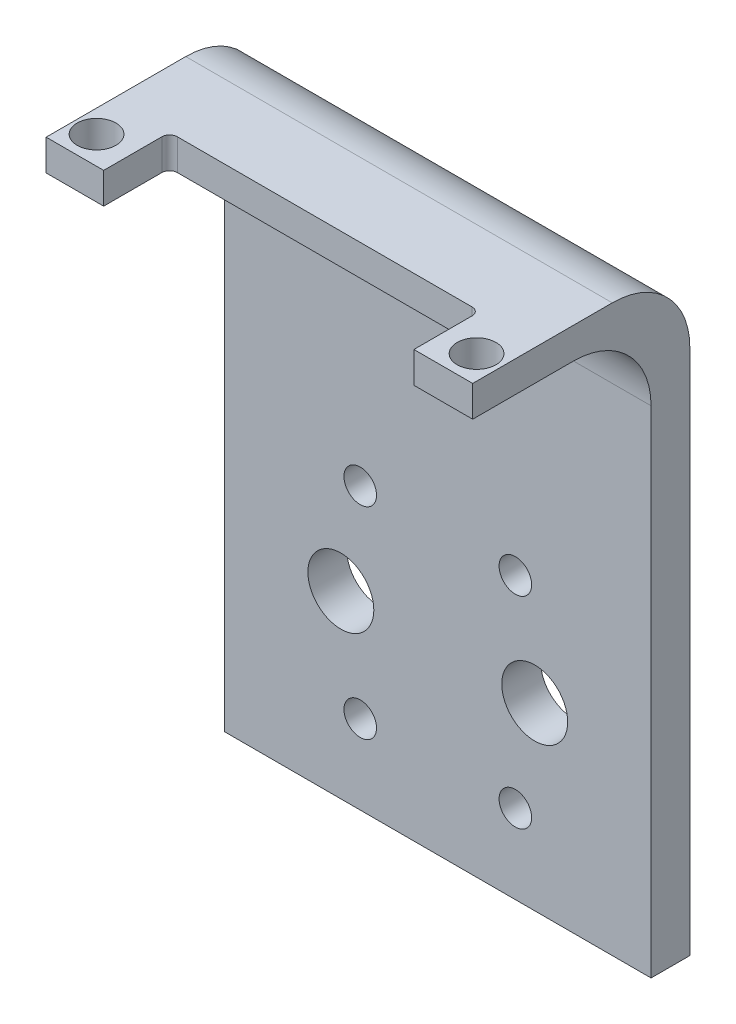
ISO-10303-21;
HEADER;
FILE_DESCRIPTION(('STEP AP214'),'2;1');
FILE_NAME('part.step','',(''),(''),'','','');
FILE_SCHEMA(('AUTOMOTIVE_DESIGN { 1 0 10303 214 1 1 1 1 }'));
ENDSEC;
DATA;
#1=APPLICATION_CONTEXT('core data for automotive mechanical design processes');
#2=APPLICATION_PROTOCOL_DEFINITION('international standard','automotive_design',2000,#1);
#3=PRODUCT_CONTEXT('',#1,'mechanical');
#4=PRODUCT('Part','Part','',(#3));
#5=PRODUCT_RELATED_PRODUCT_CATEGORY('part','',(#4));
#6=PRODUCT_DEFINITION_FORMATION('','',#4);
#7=PRODUCT_DEFINITION_CONTEXT('part definition',#1,'design');
#8=PRODUCT_DEFINITION('design','',#6,#7);
#9=PRODUCT_DEFINITION_SHAPE('','',#8);
#10=(LENGTH_UNIT() NAMED_UNIT(*) SI_UNIT(.MILLI.,.METRE.));
#11=(NAMED_UNIT(*) PLANE_ANGLE_UNIT() SI_UNIT($,.RADIAN.));
#12=(NAMED_UNIT(*) SI_UNIT($,.STERADIAN.) SOLID_ANGLE_UNIT());
#13=UNCERTAINTY_MEASURE_WITH_UNIT(LENGTH_MEASURE(1.E-05),#10,'distance_accuracy_value','');
#14=(GEOMETRIC_REPRESENTATION_CONTEXT(3) GLOBAL_UNCERTAINTY_ASSIGNED_CONTEXT((#13)) GLOBAL_UNIT_ASSIGNED_CONTEXT((#10,
#11,#12)) REPRESENTATION_CONTEXT('',''));
#15=CARTESIAN_POINT('',(0.,0.,0.));
#16=DIRECTION('',(0.,0.,1.));
#17=DIRECTION('',(1.,0.,0.));
#18=AXIS2_PLACEMENT_3D('',#15,#16,#17);
#19=CARTESIAN_POINT('',(-27.4176015384619,54.1685848951049,28.));
#20=DIRECTION('',(0.,0.,-1.));
#21=DIRECTION('',(-1.,0.,0.));
#22=AXIS2_PLACEMENT_3D('',#19,#20,#21);
#23=PLANE('',#22);
#24=DIRECTION('',(1.,0.,0.));
#25=VECTOR('',#24,1.);
#26=CARTESIAN_POINT('',(-27.4176015384619,54.1685848951049,28.));
#27=LINE('',#26,#25);
#28=CARTESIAN_POINT('',(20.,54.1685848951049,28.));
#29=VERTEX_POINT('',#28);
#30=CARTESIAN_POINT('',(27.5823984615396,54.1685848951049,28.));
#31=VERTEX_POINT('',#30);
#32=EDGE_CURVE('E211',#29,#31,#27,.T.);
#33=ORIENTED_EDGE('',*,*,#32,.F.);
#34=DIRECTION('',(0.,-1.,0.));
#35=VECTOR('',#34,1.);
#36=CARTESIAN_POINT('',(20.,54.1685848951049,28.));
#37=LINE('',#36,#35);
#38=CARTESIAN_POINT('',(20.,50.1685848951049,28.));
#39=VERTEX_POINT('',#38);
#40=EDGE_CURVE('E203',#29,#39,#37,.T.);
#41=ORIENTED_EDGE('',*,*,#40,.T.);
#42=DIRECTION('',(1.,0.,0.));
#43=VECTOR('',#42,1.);
#44=CARTESIAN_POINT('',(-27.4176015384619,50.1685848951049,28.));
#45=LINE('',#44,#43);
#46=CARTESIAN_POINT('',(27.5823984615396,50.1685848951049,28.));
#47=VERTEX_POINT('',#46);
#48=EDGE_CURVE('E224',#39,#47,#45,.T.);
#49=ORIENTED_EDGE('',*,*,#48,.T.);
#50=DIRECTION('',(0.,-1.,0.));
#51=VECTOR('',#50,1.);
#52=CARTESIAN_POINT('',(27.5823984615396,54.1685848951049,28.));
#53=LINE('',#52,#51);
#54=EDGE_CURVE('E221',#31,#47,#53,.T.);
#55=ORIENTED_EDGE('',*,*,#54,.F.);
#56=EDGE_LOOP('',(#33,#41,#49,#55));
#57=FACE_BOUND('',#56,.T.);
#58=ADVANCED_FACE('F39',(#57),#23,.F.);
#59=CARTESIAN_POINT('',(0.0823984615384559,-88.7275100518437,5.));
#60=DIRECTION('',(0.,0.,1.));
#61=DIRECTION('',(1.,0.,0.));
#62=AXIS2_PLACEMENT_3D('',#59,#60,#61);
#63=PLANE('',#62);
#64=DIRECTION('',(0.,-1.,0.));
#65=VECTOR('',#64,1.);
#66=CARTESIAN_POINT('',(27.5823984615396,30.1685848951049,5.));
#67=LINE('',#66,#65);
#68=CARTESIAN_POINT('',(27.5823984615396,40.1685848951049,5.));
#69=VERTEX_POINT('',#68);
#70=CARTESIAN_POINT('',(27.5823984615396,-23.7275100518435,5.));
#71=VERTEX_POINT('',#70);
#72=EDGE_CURVE('E249',#69,#71,#67,.T.);
#73=ORIENTED_EDGE('',*,*,#72,.F.);
#74=DIRECTION('',(1.,0.,0.));
#75=VECTOR('',#74,1.);
#76=CARTESIAN_POINT('',(0.0823984615384884,40.1685848951049,5.));
#77=LINE('',#76,#75);
#78=CARTESIAN_POINT('',(-27.4176015384619,40.1685848951049,5.));
#79=VERTEX_POINT('',#78);
#80=EDGE_CURVE('E318',#69,#79,#77,.F.);
#81=ORIENTED_EDGE('',*,*,#80,.T.);
#82=DIRECTION('',(0.,1.,0.));
#83=VECTOR('',#82,1.);
#84=CARTESIAN_POINT('',(-27.4176015384619,30.1685848951049,5.));
#85=LINE('',#84,#83);
#86=CARTESIAN_POINT('',(-27.4176015384619,-23.7275100518435,5.));
#87=VERTEX_POINT('',#86);
#88=EDGE_CURVE('E250',#87,#79,#85,.T.);
#89=ORIENTED_EDGE('',*,*,#88,.F.);
#90=DIRECTION('',(-1.,0.,0.));
#91=VECTOR('',#90,1.);
#92=CARTESIAN_POINT('',(-30.472919294877,-23.7275100518435,5.));
#93=LINE('',#92,#91);
#94=EDGE_CURVE('E239',#71,#87,#93,.T.);
#95=ORIENTED_EDGE('',*,*,#94,.F.);
#96=EDGE_LOOP('',(#73,#81,#89,#95));
#97=FACE_BOUND('',#96,.T.);
#98=CARTESIAN_POINT('',(-9.91760153846116,12.4801480931158,5.));
#99=DIRECTION('',(0.,0.,1.));
#100=DIRECTION('',(1.,0.,0.));
#101=AXIS2_PLACEMENT_3D('',#98,#99,#100);
#102=CIRCLE('',#101,2.1);
#103=CARTESIAN_POINT('',(-7.81760153846116,12.4801480931158,5.));
#104=VERTEX_POINT('',#103);
#105=EDGE_CURVE('E271',#104,#104,#102,.T.);
#106=ORIENTED_EDGE('',*,*,#105,.F.);
#107=EDGE_LOOP('',(#106));
#108=FACE_BOUND('',#107,.T.);
#109=CARTESIAN_POINT('',(-9.91760153846117,-13.5198519068842,5.));
#110=DIRECTION('',(0.,0.,1.));
#111=DIRECTION('',(1.,0.,0.));
#112=AXIS2_PLACEMENT_3D('',#109,#110,#111);
#113=CIRCLE('',#112,2.09999999999999);
#114=CARTESIAN_POINT('',(-7.81760153846118,-13.5198519068842,5.));
#115=VERTEX_POINT('',#114);
#116=EDGE_CURVE('E287',#115,#115,#113,.T.);
#117=ORIENTED_EDGE('',*,*,#116,.F.);
#118=EDGE_LOOP('',(#117));
#119=FACE_BOUND('',#118,.T.);
#120=CARTESIAN_POINT('',(12.5823984615388,-0.519851906884222,5.));
#121=DIRECTION('',(0.,0.,1.));
#122=DIRECTION('',(1.,0.,0.));
#123=AXIS2_PLACEMENT_3D('',#120,#121,#122);
#124=CIRCLE('',#123,4.25);
#125=CARTESIAN_POINT('',(16.8323984615388,-0.519851906884222,5.));
#126=VERTEX_POINT('',#125);
#127=EDGE_CURVE('E303',#126,#126,#124,.T.);
#128=ORIENTED_EDGE('',*,*,#127,.F.);
#129=EDGE_LOOP('',(#128));
#130=FACE_BOUND('',#129,.T.);
#131=CARTESIAN_POINT('',(10.0823984615388,-13.5198519068842,5.));
#132=DIRECTION('',(0.,0.,1.));
#133=DIRECTION('',(1.,0.,0.));
#134=AXIS2_PLACEMENT_3D('',#131,#132,#133);
#135=CIRCLE('',#134,2.1);
#136=CARTESIAN_POINT('',(12.1823984615388,-13.5198519068842,5.));
#137=VERTEX_POINT('',#136);
#138=EDGE_CURVE('E295',#137,#137,#135,.T.);
#139=ORIENTED_EDGE('',*,*,#138,.F.);
#140=EDGE_LOOP('',(#139));
#141=FACE_BOUND('',#140,.T.);
#142=CARTESIAN_POINT('',(-12.4176015384612,-0.519851906884215,5.));
#143=DIRECTION('',(0.,0.,1.));
#144=DIRECTION('',(1.,0.,0.));
#145=AXIS2_PLACEMENT_3D('',#142,#143,#144);
#146=CIRCLE('',#145,4.25);
#147=CARTESIAN_POINT('',(-8.16760153846116,-0.519851906884215,5.));
#148=VERTEX_POINT('',#147);
#149=EDGE_CURVE('E279',#148,#148,#146,.T.);
#150=ORIENTED_EDGE('',*,*,#149,.F.);
#151=EDGE_LOOP('',(#150));
#152=FACE_BOUND('',#151,.T.);
#153=CARTESIAN_POINT('',(10.0823984615388,12.4801480931158,5.));
#154=DIRECTION('',(0.,0.,1.));
#155=DIRECTION('',(1.,0.,0.));
#156=AXIS2_PLACEMENT_3D('',#153,#154,#155);
#157=CIRCLE('',#156,2.09999999999999);
#158=CARTESIAN_POINT('',(12.1823984615388,12.4801480931158,5.));
#159=VERTEX_POINT('',#158);
#160=EDGE_CURVE('E263',#159,#159,#157,.T.);
#161=ORIENTED_EDGE('',*,*,#160,.F.);
#162=EDGE_LOOP('',(#161));
#163=FACE_BOUND('',#162,.T.);
#164=ADVANCED_FACE('F355',(#97,#108,#119,#130,#141,#152,#163),#63,.T.);
#165=CARTESIAN_POINT('',(0.0823984615384559,-88.7275100518437,0.));
#166=DIRECTION('',(0.,0.,1.));
#167=DIRECTION('',(1.,0.,0.));
#168=AXIS2_PLACEMENT_3D('',#165,#166,#167);
#169=PLANE('',#168);
#170=DIRECTION('',(0.,1.,0.));
#171=VECTOR('',#170,1.);
#172=CARTESIAN_POINT('',(-27.4176015384619,-88.7275100518437,0.));
#173=LINE('',#172,#171);
#174=CARTESIAN_POINT('',(-27.4176015384619,-23.7275100518435,0.));
#175=VERTEX_POINT('',#174);
#176=CARTESIAN_POINT('',(-27.4176015384619,44.1685848951049,0.));
#177=VERTEX_POINT('',#176);
#178=EDGE_CURVE('E259',#175,#177,#173,.T.);
#179=ORIENTED_EDGE('',*,*,#178,.T.);
#180=DIRECTION('',(-1.,0.,0.));
#181=VECTOR('',#180,1.);
#182=CARTESIAN_POINT('',(27.5823984615396,44.1685848951049,0.));
#183=LINE('',#182,#181);
#184=CARTESIAN_POINT('',(27.5823984615396,44.1685848951049,0.));
#185=VERTEX_POINT('',#184);
#186=EDGE_CURVE('E63',#177,#185,#183,.F.);
#187=ORIENTED_EDGE('',*,*,#186,.T.);
#188=DIRECTION('',(0.,-1.,0.));
#189=VECTOR('',#188,1.);
#190=CARTESIAN_POINT('',(27.5823984615396,-88.7275100518437,0.));
#191=LINE('',#190,#189);
#192=CARTESIAN_POINT('',(27.5823984615396,-23.7275100518435,0.));
#193=VERTEX_POINT('',#192);
#194=EDGE_CURVE('E254',#185,#193,#191,.T.);
#195=ORIENTED_EDGE('',*,*,#194,.T.);
#196=DIRECTION('',(-1.,0.,0.));
#197=VECTOR('',#196,1.);
#198=CARTESIAN_POINT('',(0.0823984615384559,-23.7275100518435,0.));
#199=LINE('',#198,#197);
#200=EDGE_CURVE('E242',#193,#175,#199,.T.);
#201=ORIENTED_EDGE('',*,*,#200,.T.);
#202=EDGE_LOOP('',(#179,#187,#195,#201));
#203=FACE_BOUND('',#202,.T.);
#204=CARTESIAN_POINT('',(10.0823984615388,12.4801480931158,0.));
#205=DIRECTION('',(0.,0.,1.));
#206=DIRECTION('',(1.,0.,0.));
#207=AXIS2_PLACEMENT_3D('',#204,#205,#206);
#208=CIRCLE('',#207,2.09999999999999);
#209=CARTESIAN_POINT('',(12.1823984615388,12.4801480931158,0.));
#210=VERTEX_POINT('',#209);
#211=EDGE_CURVE('E262',#210,#210,#208,.T.);
#212=ORIENTED_EDGE('',*,*,#211,.T.);
#213=EDGE_LOOP('',(#212));
#214=FACE_BOUND('',#213,.T.);
#215=CARTESIAN_POINT('',(-9.91760153846116,12.4801480931158,0.));
#216=DIRECTION('',(0.,0.,1.));
#217=DIRECTION('',(1.,0.,0.));
#218=AXIS2_PLACEMENT_3D('',#215,#216,#217);
#219=CIRCLE('',#218,2.1);
#220=CARTESIAN_POINT('',(-7.81760153846116,12.4801480931158,0.));
#221=VERTEX_POINT('',#220);
#222=EDGE_CURVE('E267',#221,#221,#219,.T.);
#223=ORIENTED_EDGE('',*,*,#222,.T.);
#224=EDGE_LOOP('',(#223));
#225=FACE_BOUND('',#224,.T.);
#226=CARTESIAN_POINT('',(-12.4176015384612,-0.519851906884215,0.));
#227=DIRECTION('',(0.,0.,1.));
#228=DIRECTION('',(1.,0.,0.));
#229=AXIS2_PLACEMENT_3D('',#226,#227,#228);
#230=CIRCLE('',#229,4.25);
#231=CARTESIAN_POINT('',(-8.16760153846116,-0.519851906884215,0.));
#232=VERTEX_POINT('',#231);
#233=EDGE_CURVE('E275',#232,#232,#230,.T.);
#234=ORIENTED_EDGE('',*,*,#233,.T.);
#235=EDGE_LOOP('',(#234));
#236=FACE_BOUND('',#235,.T.);
#237=CARTESIAN_POINT('',(-9.91760153846117,-13.5198519068842,0.));
#238=DIRECTION('',(0.,0.,1.));
#239=DIRECTION('',(1.,0.,0.));
#240=AXIS2_PLACEMENT_3D('',#237,#238,#239);
#241=CIRCLE('',#240,2.09999999999999);
#242=CARTESIAN_POINT('',(-7.81760153846118,-13.5198519068842,0.));
#243=VERTEX_POINT('',#242);
#244=EDGE_CURVE('E283',#243,#243,#241,.T.);
#245=ORIENTED_EDGE('',*,*,#244,.T.);
#246=EDGE_LOOP('',(#245));
#247=FACE_BOUND('',#246,.T.);
#248=CARTESIAN_POINT('',(10.0823984615388,-13.5198519068842,0.));
#249=DIRECTION('',(0.,0.,1.));
#250=DIRECTION('',(1.,0.,0.));
#251=AXIS2_PLACEMENT_3D('',#248,#249,#250);
#252=CIRCLE('',#251,2.1);
#253=CARTESIAN_POINT('',(12.1823984615388,-13.5198519068842,0.));
#254=VERTEX_POINT('',#253);
#255=EDGE_CURVE('E291',#254,#254,#252,.T.);
#256=ORIENTED_EDGE('',*,*,#255,.T.);
#257=EDGE_LOOP('',(#256));
#258=FACE_BOUND('',#257,.T.);
#259=CARTESIAN_POINT('',(12.5823984615388,-0.519851906884222,0.));
#260=DIRECTION('',(0.,0.,1.));
#261=DIRECTION('',(1.,0.,0.));
#262=AXIS2_PLACEMENT_3D('',#259,#260,#261);
#263=CIRCLE('',#262,4.25);
#264=CARTESIAN_POINT('',(16.8323984615388,-0.519851906884222,0.));
#265=VERTEX_POINT('',#264);
#266=EDGE_CURVE('E299',#265,#265,#263,.T.);
#267=ORIENTED_EDGE('',*,*,#266,.T.);
#268=EDGE_LOOP('',(#267));
#269=FACE_BOUND('',#268,.T.);
#270=ADVANCED_FACE('F362',(#203,#214,#225,#236,#247,#258,#269),#169,.F.);
#271=CARTESIAN_POINT('',(12.5823984615388,-0.519851906884222,5.));
#272=DIRECTION('',(0.,0.,-1.));
#273=DIRECTION('',(-1.,0.,0.));
#274=AXIS2_PLACEMENT_3D('',#271,#272,#273);
#275=CYLINDRICAL_SURFACE('',#274,4.25);
#276=ORIENTED_EDGE('',*,*,#127,.T.);
#277=EDGE_LOOP('',(#276));
#278=FACE_BOUND('',#277,.T.);
#279=ORIENTED_EDGE('',*,*,#266,.F.);
#280=EDGE_LOOP('',(#279));
#281=FACE_BOUND('',#280,.T.);
#282=ADVANCED_FACE('F527',(#278,#281),#275,.F.);
#283=CARTESIAN_POINT('',(10.0823984615388,-13.5198519068842,5.));
#284=DIRECTION('',(0.,0.,-1.));
#285=DIRECTION('',(-1.,0.,0.));
#286=AXIS2_PLACEMENT_3D('',#283,#284,#285);
#287=CYLINDRICAL_SURFACE('',#286,2.1);
#288=ORIENTED_EDGE('',*,*,#138,.T.);
#289=EDGE_LOOP('',(#288));
#290=FACE_BOUND('',#289,.T.);
#291=ORIENTED_EDGE('',*,*,#255,.F.);
#292=EDGE_LOOP('',(#291));
#293=FACE_BOUND('',#292,.T.);
#294=ADVANCED_FACE('F581',(#290,#293),#287,.F.);
#295=CARTESIAN_POINT('',(-9.91760153846117,-13.5198519068842,5.));
#296=DIRECTION('',(0.,0.,-1.));
#297=DIRECTION('',(-1.,0.,0.));
#298=AXIS2_PLACEMENT_3D('',#295,#296,#297);
#299=CYLINDRICAL_SURFACE('',#298,2.09999999999999);
#300=ORIENTED_EDGE('',*,*,#116,.T.);
#301=EDGE_LOOP('',(#300));
#302=FACE_BOUND('',#301,.T.);
#303=ORIENTED_EDGE('',*,*,#244,.F.);
#304=EDGE_LOOP('',(#303));
#305=FACE_BOUND('',#304,.T.);
#306=ADVANCED_FACE('F571',(#302,#305),#299,.F.);
#307=CARTESIAN_POINT('',(-12.4176015384612,-0.519851906884215,5.));
#308=DIRECTION('',(0.,0.,-1.));
#309=DIRECTION('',(-1.,0.,0.));
#310=AXIS2_PLACEMENT_3D('',#307,#308,#309);
#311=CYLINDRICAL_SURFACE('',#310,4.25);
#312=ORIENTED_EDGE('',*,*,#149,.T.);
#313=EDGE_LOOP('',(#312));
#314=FACE_BOUND('',#313,.T.);
#315=ORIENTED_EDGE('',*,*,#233,.F.);
#316=EDGE_LOOP('',(#315));
#317=FACE_BOUND('',#316,.T.);
#318=ADVANCED_FACE('F561',(#314,#317),#311,.F.);
#319=CARTESIAN_POINT('',(-9.91760153846116,12.4801480931158,5.));
#320=DIRECTION('',(0.,0.,-1.));
#321=DIRECTION('',(-1.,0.,0.));
#322=AXIS2_PLACEMENT_3D('',#319,#320,#321);
#323=CYLINDRICAL_SURFACE('',#322,2.1);
#324=ORIENTED_EDGE('',*,*,#105,.T.);
#325=EDGE_LOOP('',(#324));
#326=FACE_BOUND('',#325,.T.);
#327=ORIENTED_EDGE('',*,*,#222,.F.);
#328=EDGE_LOOP('',(#327));
#329=FACE_BOUND('',#328,.T.);
#330=ADVANCED_FACE('F551',(#326,#329),#323,.F.);
#331=CARTESIAN_POINT('',(10.0823984615388,12.4801480931158,5.));
#332=DIRECTION('',(0.,0.,-1.));
#333=DIRECTION('',(-1.,0.,0.));
#334=AXIS2_PLACEMENT_3D('',#331,#332,#333);
#335=CYLINDRICAL_SURFACE('',#334,2.09999999999999);
#336=ORIENTED_EDGE('',*,*,#160,.T.);
#337=EDGE_LOOP('',(#336));
#338=FACE_BOUND('',#337,.T.);
#339=ORIENTED_EDGE('',*,*,#211,.F.);
#340=EDGE_LOOP('',(#339));
#341=FACE_BOUND('',#340,.T.);
#342=ADVANCED_FACE('F516',(#338,#341),#335,.F.);
#343=CARTESIAN_POINT('',(27.5823984615396,30.1685848951049,-5.));
#344=DIRECTION('',(-1.,0.,0.));
#345=DIRECTION('',(0.,0.,1.));
#346=AXIS2_PLACEMENT_3D('',#343,#344,#345);
#347=PLANE('',#346);
#348=ORIENTED_EDGE('',*,*,#194,.F.);
#349=CARTESIAN_POINT('',(27.5823984615396,44.1685848951049,10.));
#350=DIRECTION('',(-1.,0.,0.));
#351=DIRECTION('',(0.,0.,1.));
#352=AXIS2_PLACEMENT_3D('',#349,#350,#351);
#353=CIRCLE('',#352,10.);
#354=CARTESIAN_POINT('',(27.5823984615396,54.1685848951049,10.));
#355=VERTEX_POINT('',#354);
#356=EDGE_CURVE('E330',#185,#355,#353,.F.);
#357=ORIENTED_EDGE('',*,*,#356,.T.);
#358=DIRECTION('',(0.,0.,-1.));
#359=VECTOR('',#358,1.);
#360=CARTESIAN_POINT('',(27.5823984615396,54.1685848951049,0.));
#361=LINE('',#360,#359);
#362=EDGE_CURVE('E217',#31,#355,#361,.T.);
#363=ORIENTED_EDGE('',*,*,#362,.F.);
#364=ORIENTED_EDGE('',*,*,#54,.T.);
#365=DIRECTION('',(0.,0.,-1.));
#366=VECTOR('',#365,1.);
#367=CARTESIAN_POINT('',(27.5823984615396,50.1685848951049,0.));
#368=LINE('',#367,#366);
#369=CARTESIAN_POINT('',(27.5823984615396,50.1685848951049,15.));
#370=VERTEX_POINT('',#369);
#371=EDGE_CURVE('E212',#47,#370,#368,.T.);
#372=ORIENTED_EDGE('',*,*,#371,.T.);
#373=CARTESIAN_POINT('',(27.5823984615396,40.1685848951049,15.));
#374=DIRECTION('',(-1.,0.,0.));
#375=DIRECTION('',(0.,0.,1.));
#376=AXIS2_PLACEMENT_3D('',#373,#374,#375);
#377=CIRCLE('',#376,10.);
#378=EDGE_CURVE('E333',#370,#69,#377,.T.);
#379=ORIENTED_EDGE('',*,*,#378,.T.);
#380=ORIENTED_EDGE('',*,*,#72,.T.);
#381=DIRECTION('',(0.,0.,-1.));
#382=VECTOR('',#381,1.);
#383=CARTESIAN_POINT('',(27.5823984615396,-23.7275100518435,-5.));
#384=LINE('',#383,#382);
#385=EDGE_CURVE('E245',#71,#193,#384,.T.);
#386=ORIENTED_EDGE('',*,*,#385,.T.);
#387=EDGE_LOOP('',(#348,#357,#363,#364,#372,#379,#380,#386));
#388=FACE_BOUND('',#387,.T.);
#389=ADVANCED_FACE('F351',(#388),#347,.F.);
#390=CARTESIAN_POINT('',(-27.4176015384619,30.1685848951049,-5.));
#391=DIRECTION('',(1.,0.,0.));
#392=DIRECTION('',(0.,0.,-1.));
#393=AXIS2_PLACEMENT_3D('',#390,#391,#392);
#394=PLANE('',#393);
#395=DIRECTION('',(0.,0.,1.));
#396=VECTOR('',#395,1.);
#397=CARTESIAN_POINT('',(-27.4176015384619,54.1685848951049,0.));
#398=LINE('',#397,#396);
#399=CARTESIAN_POINT('',(-27.4176015384619,54.1685848951049,10.));
#400=VERTEX_POINT('',#399);
#401=CARTESIAN_POINT('',(-27.4176015384619,54.1685848951049,28.));
#402=VERTEX_POINT('',#401);
#403=EDGE_CURVE('E208',#400,#402,#398,.T.);
#404=ORIENTED_EDGE('',*,*,#403,.F.);
#405=CARTESIAN_POINT('',(-27.4176015384619,44.1685848951049,10.));
#406=DIRECTION('',(1.,0.,0.));
#407=DIRECTION('',(0.,0.,-1.));
#408=AXIS2_PLACEMENT_3D('',#405,#406,#407);
#409=CIRCLE('',#408,10.);
#410=EDGE_CURVE('E325',#400,#177,#409,.F.);
#411=ORIENTED_EDGE('',*,*,#410,.T.);
#412=ORIENTED_EDGE('',*,*,#178,.F.);
#413=DIRECTION('',(0.,0.,1.));
#414=VECTOR('',#413,1.);
#415=CARTESIAN_POINT('',(-27.4176015384619,-23.7275100518435,-5.));
#416=LINE('',#415,#414);
#417=EDGE_CURVE('E307',#175,#87,#416,.T.);
#418=ORIENTED_EDGE('',*,*,#417,.T.);
#419=ORIENTED_EDGE('',*,*,#88,.T.);
#420=CARTESIAN_POINT('',(-27.4176015384619,40.1685848951049,15.));
#421=DIRECTION('',(1.,0.,0.));
#422=DIRECTION('',(0.,0.,-1.));
#423=AXIS2_PLACEMENT_3D('',#420,#421,#422);
#424=CIRCLE('',#423,10.);
#425=CARTESIAN_POINT('',(-27.4176015384619,50.1685848951049,15.));
#426=VERTEX_POINT('',#425);
#427=EDGE_CURVE('E48',#79,#426,#424,.T.);
#428=ORIENTED_EDGE('',*,*,#427,.T.);
#429=DIRECTION('',(0.,0.,1.));
#430=VECTOR('',#429,1.);
#431=CARTESIAN_POINT('',(-27.4176015384619,50.1685848951049,0.));
#432=LINE('',#431,#430);
#433=CARTESIAN_POINT('',(-27.4176015384619,50.1685848951049,28.));
#434=VERTEX_POINT('',#433);
#435=EDGE_CURVE('E207',#426,#434,#432,.T.);
#436=ORIENTED_EDGE('',*,*,#435,.T.);
#437=DIRECTION('',(0.,-1.,0.));
#438=VECTOR('',#437,1.);
#439=CARTESIAN_POINT('',(-27.4176015384619,54.1685848951049,28.));
#440=LINE('',#439,#438);
#441=EDGE_CURVE('E235',#402,#434,#440,.T.);
#442=ORIENTED_EDGE('',*,*,#441,.F.);
#443=EDGE_LOOP('',(#404,#411,#412,#418,#419,#428,#436,#442));
#444=FACE_BOUND('',#443,.T.);
#445=ADVANCED_FACE('F340',(#444),#394,.F.);
#446=CARTESIAN_POINT('',(-30.472919294877,-23.7275100518435,-5.));
#447=DIRECTION('',(0.,1.,0.));
#448=DIRECTION('',(0.,0.,1.));
#449=AXIS2_PLACEMENT_3D('',#446,#447,#448);
#450=PLANE('',#449);
#451=ORIENTED_EDGE('',*,*,#200,.F.);
#452=ORIENTED_EDGE('',*,*,#385,.F.);
#453=ORIENTED_EDGE('',*,*,#94,.T.);
#454=ORIENTED_EDGE('',*,*,#417,.F.);
#455=EDGE_LOOP('',(#451,#452,#453,#454));
#456=FACE_BOUND('',#455,.T.);
#457=ADVANCED_FACE('F360',(#456),#450,.F.);
#458=CARTESIAN_POINT('',(0.,50.1685848951049,0.));
#459=DIRECTION('',(0.,1.,0.));
#460=DIRECTION('',(-1.,0.,0.));
#461=AXIS2_PLACEMENT_3D('',#458,#459,#460);
#462=PLANE('',#461);
#463=CARTESIAN_POINT('',(24.5,50.1685848951049,24.42));
#464=DIRECTION('',(0.,1.,0.));
#465=DIRECTION('',(1.,0.,0.));
#466=AXIS2_PLACEMENT_3D('',#463,#464,#465);
#467=CIRCLE('',#466,2.49999999999999);
#468=CARTESIAN_POINT('',(27.,50.1685848951049,24.42));
#469=VERTEX_POINT('',#468);
#470=EDGE_CURVE('E648',#469,#469,#467,.T.);
#471=ORIENTED_EDGE('',*,*,#470,.T.);
#472=EDGE_LOOP('',(#471));
#473=FACE_BOUND('',#472,.T.);
#474=CARTESIAN_POINT('',(-24.5,50.1685848951049,24.42));
#475=DIRECTION('',(0.,1.,0.));
#476=DIRECTION('',(-1.,0.,0.));
#477=AXIS2_PLACEMENT_3D('',#474,#475,#476);
#478=CIRCLE('',#477,2.5);
#479=CARTESIAN_POINT('',(-27.,50.1685848951049,24.42));
#480=VERTEX_POINT('',#479);
#481=EDGE_CURVE('E185',#480,#480,#478,.T.);
#482=ORIENTED_EDGE('',*,*,#481,.T.);
#483=EDGE_LOOP('',(#482));
#484=FACE_BOUND('',#483,.T.);
#485=ORIENTED_EDGE('',*,*,#48,.F.);
#486=DIRECTION('',(0.,0.,-1.));
#487=VECTOR('',#486,1.);
#488=CARTESIAN_POINT('',(20.,50.1685848951049,20.5));
#489=LINE('',#488,#487);
#490=CARTESIAN_POINT('',(20.,50.1685848951049,20.5));
#491=VERTEX_POINT('',#490);
#492=EDGE_CURVE('E151',#39,#491,#489,.T.);
#493=ORIENTED_EDGE('',*,*,#492,.T.);
#494=CARTESIAN_POINT('',(19.,50.1685848951049,20.5));
#495=DIRECTION('',(0.,1.,0.));
#496=DIRECTION('',(1.,0.,0.));
#497=AXIS2_PLACEMENT_3D('',#494,#495,#496);
#498=CIRCLE('',#497,1.);
#499=CARTESIAN_POINT('',(19.,50.1685848951049,19.5));
#500=VERTEX_POINT('',#499);
#501=EDGE_CURVE('E144',#491,#500,#498,.T.);
#502=ORIENTED_EDGE('',*,*,#501,.T.);
#503=DIRECTION('',(-1.,0.,0.));
#504=VECTOR('',#503,1.);
#505=CARTESIAN_POINT('',(-19.,50.1685848951049,19.5));
#506=LINE('',#505,#504);
#507=CARTESIAN_POINT('',(-19.,50.1685848951049,19.5));
#508=VERTEX_POINT('',#507);
#509=EDGE_CURVE('E154',#500,#508,#506,.T.);
#510=ORIENTED_EDGE('',*,*,#509,.T.);
#511=CARTESIAN_POINT('',(-19.,50.1685848951049,20.5));
#512=DIRECTION('',(0.,1.,0.));
#513=DIRECTION('',(-1.,0.,0.));
#514=AXIS2_PLACEMENT_3D('',#511,#512,#513);
#515=CIRCLE('',#514,1.);
#516=CARTESIAN_POINT('',(-20.,50.1685848951049,20.5));
#517=VERTEX_POINT('',#516);
#518=EDGE_CURVE('E160',#508,#517,#515,.T.);
#519=ORIENTED_EDGE('',*,*,#518,.T.);
#520=DIRECTION('',(0.,0.,1.));
#521=VECTOR('',#520,1.);
#522=CARTESIAN_POINT('',(-20.,50.1685848951049,20.5));
#523=LINE('',#522,#521);
#524=CARTESIAN_POINT('',(-20.,50.1685848951049,28.));
#525=VERTEX_POINT('',#524);
#526=EDGE_CURVE('E176',#517,#525,#523,.T.);
#527=ORIENTED_EDGE('',*,*,#526,.T.);
#528=EDGE_CURVE('E225',#434,#525,#45,.T.);
#529=ORIENTED_EDGE('',*,*,#528,.F.);
#530=ORIENTED_EDGE('',*,*,#435,.F.);
#531=DIRECTION('',(1.,0.,0.));
#532=VECTOR('',#531,1.);
#533=CARTESIAN_POINT('',(0.,50.1685848951049,15.));
#534=LINE('',#533,#532);
#535=EDGE_CURVE('E314',#426,#370,#534,.T.);
#536=ORIENTED_EDGE('',*,*,#535,.T.);
#537=ORIENTED_EDGE('',*,*,#371,.F.);
#538=EDGE_LOOP('',(#485,#493,#502,#510,#519,#527,#529,#530,#536,#537));
#539=FACE_BOUND('',#538,.T.);
#540=ADVANCED_FACE('F163',(#473,#484,#539),#462,.F.);
#541=ORIENTED_EDGE('',*,*,#528,.T.);
#542=DIRECTION('',(0.,1.,0.));
#543=VECTOR('',#542,1.);
#544=CARTESIAN_POINT('',(-20.,54.1685848951049,28.));
#545=LINE('',#544,#543);
#546=CARTESIAN_POINT('',(-20.,54.1685848951049,28.));
#547=VERTEX_POINT('',#546);
#548=EDGE_CURVE('E194',#525,#547,#545,.T.);
#549=ORIENTED_EDGE('',*,*,#548,.T.);
#550=EDGE_CURVE('E213',#402,#547,#27,.T.);
#551=ORIENTED_EDGE('',*,*,#550,.F.);
#552=ORIENTED_EDGE('',*,*,#441,.T.);
#553=EDGE_LOOP('',(#541,#549,#551,#552));
#554=FACE_BOUND('',#553,.T.);
#555=ADVANCED_FACE('F385',(#554),#23,.F.);
#556=CARTESIAN_POINT('',(0.,54.1685848951049,0.));
#557=DIRECTION('',(0.,1.,0.));
#558=DIRECTION('',(-1.,0.,0.));
#559=AXIS2_PLACEMENT_3D('',#556,#557,#558);
#560=PLANE('',#559);
#561=CARTESIAN_POINT('',(24.5,54.1685848951049,24.42));
#562=DIRECTION('',(0.,1.,0.));
#563=DIRECTION('',(1.,0.,0.));
#564=AXIS2_PLACEMENT_3D('',#561,#562,#563);
#565=CIRCLE('',#564,2.49999999999999);
#566=CARTESIAN_POINT('',(27.,54.1685848951049,24.42));
#567=VERTEX_POINT('',#566);
#568=EDGE_CURVE('E171',#567,#567,#565,.T.);
#569=ORIENTED_EDGE('',*,*,#568,.F.);
#570=EDGE_LOOP('',(#569));
#571=FACE_BOUND('',#570,.T.);
#572=CARTESIAN_POINT('',(-24.5,54.1685848951049,24.42));
#573=DIRECTION('',(0.,1.,0.));
#574=DIRECTION('',(-1.,0.,0.));
#575=AXIS2_PLACEMENT_3D('',#572,#573,#574);
#576=CIRCLE('',#575,2.5);
#577=CARTESIAN_POINT('',(-27.,54.1685848951049,24.42));
#578=VERTEX_POINT('',#577);
#579=EDGE_CURVE('E653',#578,#578,#576,.T.);
#580=ORIENTED_EDGE('',*,*,#579,.F.);
#581=EDGE_LOOP('',(#580));
#582=FACE_BOUND('',#581,.T.);
#583=DIRECTION('',(0.,0.,-1.));
#584=VECTOR('',#583,1.);
#585=CARTESIAN_POINT('',(20.,54.1685848951049,0.));
#586=LINE('',#585,#584);
#587=CARTESIAN_POINT('',(20.,54.1685848951049,20.5));
#588=VERTEX_POINT('',#587);
#589=EDGE_CURVE('E11',#29,#588,#586,.T.);
#590=ORIENTED_EDGE('',*,*,#589,.F.);
#591=ORIENTED_EDGE('',*,*,#32,.T.);
#592=ORIENTED_EDGE('',*,*,#362,.T.);
#593=DIRECTION('',(-1.,0.,0.));
#594=VECTOR('',#593,1.);
#595=CARTESIAN_POINT('',(-27.4176015384619,54.1685848951049,10.));
#596=LINE('',#595,#594);
#597=EDGE_CURVE('E321',#355,#400,#596,.T.);
#598=ORIENTED_EDGE('',*,*,#597,.T.);
#599=ORIENTED_EDGE('',*,*,#403,.T.);
#600=ORIENTED_EDGE('',*,*,#550,.T.);
#601=DIRECTION('',(0.,0.,1.));
#602=VECTOR('',#601,1.);
#603=CARTESIAN_POINT('',(-20.,54.1685848951049,20.5));
#604=LINE('',#603,#602);
#605=CARTESIAN_POINT('',(-20.,54.1685848951049,20.5));
#606=VERTEX_POINT('',#605);
#607=EDGE_CURVE('E165',#606,#547,#604,.T.);
#608=ORIENTED_EDGE('',*,*,#607,.F.);
#609=CARTESIAN_POINT('',(-19.,54.1685848951049,20.5));
#610=DIRECTION('',(0.,1.,0.));
#611=DIRECTION('',(-1.,0.,0.));
#612=AXIS2_PLACEMENT_3D('',#609,#610,#611);
#613=CIRCLE('',#612,1.);
#614=CARTESIAN_POINT('',(-19.,54.1685848951049,19.5));
#615=VERTEX_POINT('',#614);
#616=EDGE_CURVE('E168',#615,#606,#613,.T.);
#617=ORIENTED_EDGE('',*,*,#616,.F.);
#618=DIRECTION('',(-1.,0.,0.));
#619=VECTOR('',#618,1.);
#620=CARTESIAN_POINT('',(-19.,54.1685848951049,19.5));
#621=LINE('',#620,#619);
#622=CARTESIAN_POINT('',(19.,54.1685848951049,19.5));
#623=VERTEX_POINT('',#622);
#624=EDGE_CURVE('E184',#623,#615,#621,.T.);
#625=ORIENTED_EDGE('',*,*,#624,.F.);
#626=CARTESIAN_POINT('',(19.,54.1685848951049,20.5));
#627=DIRECTION('',(0.,1.,0.));
#628=DIRECTION('',(1.,0.,0.));
#629=AXIS2_PLACEMENT_3D('',#626,#627,#628);
#630=CIRCLE('',#629,1.);
#631=EDGE_CURVE('E55',#588,#623,#630,.T.);
#632=ORIENTED_EDGE('',*,*,#631,.F.);
#633=EDGE_LOOP('',(#590,#591,#592,#598,#599,#600,#608,#617,#625,#632));
#634=FACE_BOUND('',#633,.T.);
#635=ADVANCED_FACE('F370',(#571,#582,#634),#560,.T.);
#636=CARTESIAN_POINT('',(0.,40.1685848951049,15.));
#637=DIRECTION('',(1.,0.,0.));
#638=DIRECTION('',(0.,1.,0.));
#639=AXIS2_PLACEMENT_3D('',#636,#637,#638);
#640=CYLINDRICAL_SURFACE('',#639,10.);
#641=ORIENTED_EDGE('',*,*,#427,.F.);
#642=ORIENTED_EDGE('',*,*,#80,.F.);
#643=ORIENTED_EDGE('',*,*,#378,.F.);
#644=ORIENTED_EDGE('',*,*,#535,.F.);
#645=EDGE_LOOP('',(#641,#642,#643,#644));
#646=FACE_BOUND('',#645,.T.);
#647=ADVANCED_FACE('F348',(#646),#640,.F.);
#648=CARTESIAN_POINT('',(0.,44.1685848951049,10.));
#649=DIRECTION('',(1.,0.,0.));
#650=DIRECTION('',(0.,1.,0.));
#651=AXIS2_PLACEMENT_3D('',#648,#649,#650);
#652=CYLINDRICAL_SURFACE('',#651,10.);
#653=ORIENTED_EDGE('',*,*,#356,.F.);
#654=ORIENTED_EDGE('',*,*,#186,.F.);
#655=ORIENTED_EDGE('',*,*,#410,.F.);
#656=ORIENTED_EDGE('',*,*,#597,.F.);
#657=EDGE_LOOP('',(#653,#654,#655,#656));
#658=FACE_BOUND('',#657,.T.);
#659=ADVANCED_FACE('F41',(#658),#652,.T.);
#660=CARTESIAN_POINT('',(20.,50.1685848951049,20.5));
#661=DIRECTION('',(1.,0.,0.));
#662=DIRECTION('',(0.,1.,0.));
#663=AXIS2_PLACEMENT_3D('',#660,#661,#662);
#664=PLANE('',#663);
#665=ORIENTED_EDGE('',*,*,#589,.T.);
#666=DIRECTION('',(0.,1.,0.));
#667=VECTOR('',#666,1.);
#668=CARTESIAN_POINT('',(20.,50.1685848951049,20.5));
#669=LINE('',#668,#667);
#670=EDGE_CURVE('E191',#491,#588,#669,.T.);
#671=ORIENTED_EDGE('',*,*,#670,.F.);
#672=ORIENTED_EDGE('',*,*,#492,.F.);
#673=ORIENTED_EDGE('',*,*,#40,.F.);
#674=EDGE_LOOP('',(#665,#671,#672,#673));
#675=FACE_BOUND('',#674,.T.);
#676=ADVANCED_FACE('F377',(#675),#664,.F.);
#677=CARTESIAN_POINT('',(-20.,50.1685848951049,20.5));
#678=DIRECTION('',(-1.,0.,0.));
#679=DIRECTION('',(0.,-1.,0.));
#680=AXIS2_PLACEMENT_3D('',#677,#678,#679);
#681=PLANE('',#680);
#682=ORIENTED_EDGE('',*,*,#526,.F.);
#683=DIRECTION('',(0.,1.,0.));
#684=VECTOR('',#683,1.);
#685=CARTESIAN_POINT('',(-20.,50.1685848951049,20.5));
#686=LINE('',#685,#684);
#687=EDGE_CURVE('E195',#517,#606,#686,.T.);
#688=ORIENTED_EDGE('',*,*,#687,.T.);
#689=ORIENTED_EDGE('',*,*,#607,.T.);
#690=ORIENTED_EDGE('',*,*,#548,.F.);
#691=EDGE_LOOP('',(#682,#688,#689,#690));
#692=FACE_BOUND('',#691,.T.);
#693=ADVANCED_FACE('F387',(#692),#681,.F.);
#694=CARTESIAN_POINT('',(19.,50.1685848951049,20.5));
#695=DIRECTION('',(0.,1.,0.));
#696=DIRECTION('',(-1.,0.,0.));
#697=AXIS2_PLACEMENT_3D('',#694,#695,#696);
#698=CYLINDRICAL_SURFACE('',#697,1.);
#699=ORIENTED_EDGE('',*,*,#631,.T.);
#700=DIRECTION('',(0.,1.,0.));
#701=VECTOR('',#700,1.);
#702=CARTESIAN_POINT('',(19.,50.1685848951049,19.5));
#703=LINE('',#702,#701);
#704=EDGE_CURVE('E140',#500,#623,#703,.T.);
#705=ORIENTED_EDGE('',*,*,#704,.F.);
#706=ORIENTED_EDGE('',*,*,#501,.F.);
#707=ORIENTED_EDGE('',*,*,#670,.T.);
#708=EDGE_LOOP('',(#699,#705,#706,#707));
#709=FACE_BOUND('',#708,.T.);
#710=ADVANCED_FACE('F142',(#709),#698,.F.);
#711=CARTESIAN_POINT('',(-19.,50.1685848951049,20.5));
#712=DIRECTION('',(0.,1.,0.));
#713=DIRECTION('',(-1.,0.,0.));
#714=AXIS2_PLACEMENT_3D('',#711,#712,#713);
#715=CYLINDRICAL_SURFACE('',#714,1.);
#716=ORIENTED_EDGE('',*,*,#616,.T.);
#717=ORIENTED_EDGE('',*,*,#687,.F.);
#718=ORIENTED_EDGE('',*,*,#518,.F.);
#719=DIRECTION('',(0.,1.,0.));
#720=VECTOR('',#719,1.);
#721=CARTESIAN_POINT('',(-19.,50.1685848951049,19.5));
#722=LINE('',#721,#720);
#723=EDGE_CURVE('E150',#508,#615,#722,.T.);
#724=ORIENTED_EDGE('',*,*,#723,.T.);
#725=EDGE_LOOP('',(#716,#717,#718,#724));
#726=FACE_BOUND('',#725,.T.);
#727=ADVANCED_FACE('F381',(#726),#715,.F.);
#728=CARTESIAN_POINT('',(-19.,50.1685848951049,19.5));
#729=DIRECTION('',(0.,0.,-1.));
#730=DIRECTION('',(0.,1.,0.));
#731=AXIS2_PLACEMENT_3D('',#728,#729,#730);
#732=PLANE('',#731);
#733=ORIENTED_EDGE('',*,*,#624,.T.);
#734=ORIENTED_EDGE('',*,*,#723,.F.);
#735=ORIENTED_EDGE('',*,*,#509,.F.);
#736=ORIENTED_EDGE('',*,*,#704,.T.);
#737=EDGE_LOOP('',(#733,#734,#735,#736));
#738=FACE_BOUND('',#737,.T.);
#739=ADVANCED_FACE('F155',(#738),#732,.F.);
#740=CARTESIAN_POINT('',(-24.5,50.1685848951049,24.42));
#741=DIRECTION('',(0.,1.,0.));
#742=DIRECTION('',(-1.,0.,0.));
#743=AXIS2_PLACEMENT_3D('',#740,#741,#742);
#744=CYLINDRICAL_SURFACE('',#743,2.5);
#745=ORIENTED_EDGE('',*,*,#481,.F.);
#746=EDGE_LOOP('',(#745));
#747=FACE_BOUND('',#746,.T.);
#748=ORIENTED_EDGE('',*,*,#579,.T.);
#749=EDGE_LOOP('',(#748));
#750=FACE_BOUND('',#749,.T.);
#751=ADVANCED_FACE('F421',(#747,#750),#744,.F.);
#752=CARTESIAN_POINT('',(24.5,50.1685848951049,24.42));
#753=DIRECTION('',(0.,1.,0.));
#754=DIRECTION('',(-1.,0.,0.));
#755=AXIS2_PLACEMENT_3D('',#752,#753,#754);
#756=CYLINDRICAL_SURFACE('',#755,2.49999999999999);
#757=ORIENTED_EDGE('',*,*,#470,.F.);
#758=EDGE_LOOP('',(#757));
#759=FACE_BOUND('',#758,.T.);
#760=ORIENTED_EDGE('',*,*,#568,.T.);
#761=EDGE_LOOP('',(#760));
#762=FACE_BOUND('',#761,.T.);
#763=ADVANCED_FACE('F437',(#759,#762),#756,.F.);
#764=CLOSED_SHELL('',(#58,#164,#270,#282,#294,#306,#318,#330,#342,#389,#445,#457,#540,#555,#635,
#647,#659,#676,#693,#710,#727,#739,#751,#763));
#765=MANIFOLD_SOLID_BREP('B2',#764);
#766=ADVANCED_BREP_SHAPE_REPRESENTATION('',(#18,#765),#14);
#767=SHAPE_DEFINITION_REPRESENTATION(#9,#766);
ENDSEC;
END-ISO-10303-21;
